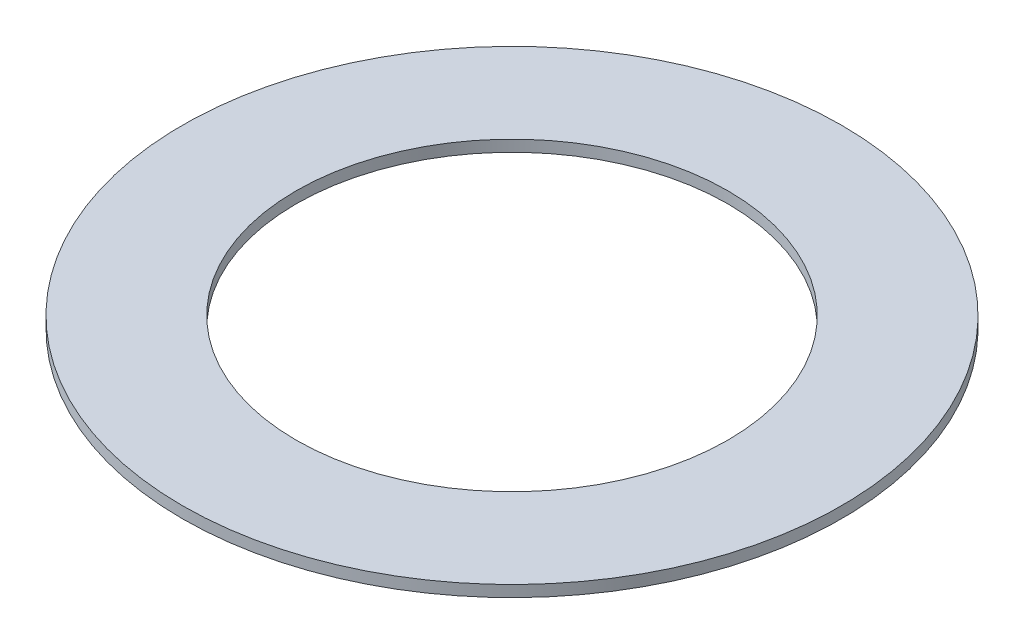
ISO-10303-21;
HEADER;
FILE_DESCRIPTION(('STEP AP214'),'2;1');
FILE_NAME('part.step','',(''),(''),'','','');
FILE_SCHEMA(('AUTOMOTIVE_DESIGN { 1 0 10303 214 1 1 1 1 }'));
ENDSEC;
DATA;
#1=APPLICATION_CONTEXT('core data for automotive mechanical design processes');
#2=APPLICATION_PROTOCOL_DEFINITION('international standard','automotive_design',2000,#1);
#3=PRODUCT_CONTEXT('',#1,'mechanical');
#4=PRODUCT('Part','Part','',(#3));
#5=PRODUCT_RELATED_PRODUCT_CATEGORY('part','',(#4));
#6=PRODUCT_DEFINITION_FORMATION('','',#4);
#7=PRODUCT_DEFINITION_CONTEXT('part definition',#1,'design');
#8=PRODUCT_DEFINITION('design','',#6,#7);
#9=PRODUCT_DEFINITION_SHAPE('','',#8);
#10=(LENGTH_UNIT() NAMED_UNIT(*) SI_UNIT(.MILLI.,.METRE.));
#11=(NAMED_UNIT(*) PLANE_ANGLE_UNIT() SI_UNIT($,.RADIAN.));
#12=(NAMED_UNIT(*) SI_UNIT($,.STERADIAN.) SOLID_ANGLE_UNIT());
#13=UNCERTAINTY_MEASURE_WITH_UNIT(LENGTH_MEASURE(1.E-05),#10,'distance_accuracy_value','');
#14=(GEOMETRIC_REPRESENTATION_CONTEXT(3) GLOBAL_UNCERTAINTY_ASSIGNED_CONTEXT((#13)) GLOBAL_UNIT_ASSIGNED_CONTEXT((#10,
#11,#12)) REPRESENTATION_CONTEXT('',''));
#15=CARTESIAN_POINT('',(0.,0.,0.));
#16=DIRECTION('',(0.,0.,1.));
#17=DIRECTION('',(1.,0.,0.));
#18=AXIS2_PLACEMENT_3D('',#15,#16,#17);
#19=CARTESIAN_POINT('',(0.,0.5,0.));
#20=DIRECTION('',(0.,1.,0.));
#21=DIRECTION('',(0.,0.,1.));
#22=AXIS2_PLACEMENT_3D('',#19,#20,#21);
#23=PLANE('',#22);
#24=CARTESIAN_POINT('',(0.,0.5,0.));
#25=DIRECTION('',(0.,1.,0.));
#26=DIRECTION('',(0.,0.,1.));
#27=AXIS2_PLACEMENT_3D('',#24,#25,#26);
#28=CIRCLE('',#27,14.5);
#29=CARTESIAN_POINT('',(0.,0.5,14.5));
#30=VERTEX_POINT('',#29);
#31=EDGE_CURVE('E11',#30,#30,#28,.T.);
#32=ORIENTED_EDGE('',*,*,#31,.T.);
#33=EDGE_LOOP('',(#32));
#34=FACE_BOUND('',#33,.T.);
#35=CARTESIAN_POINT('',(0.,0.5,0.));
#36=DIRECTION('',(0.,1.,0.));
#37=DIRECTION('',(1.,0.,0.));
#38=AXIS2_PLACEMENT_3D('',#35,#36,#37);
#39=CIRCLE('',#38,9.5);
#40=CARTESIAN_POINT('',(9.5,0.5,0.));
#41=VERTEX_POINT('',#40);
#42=EDGE_CURVE('E49',#41,#41,#39,.T.);
#43=ORIENTED_EDGE('',*,*,#42,.F.);
#44=EDGE_LOOP('',(#43));
#45=FACE_BOUND('',#44,.T.);
#46=ADVANCED_FACE('F38',(#34,#45),#23,.T.);
#47=CARTESIAN_POINT('',(0.,0.,0.));
#48=DIRECTION('',(0.,1.,0.));
#49=DIRECTION('',(0.,0.,1.));
#50=AXIS2_PLACEMENT_3D('',#47,#48,#49);
#51=PLANE('',#50);
#52=CARTESIAN_POINT('',(0.,0.,0.));
#53=DIRECTION('',(0.,1.,0.));
#54=DIRECTION('',(0.,0.,1.));
#55=AXIS2_PLACEMENT_3D('',#52,#53,#54);
#56=CIRCLE('',#55,14.5);
#57=CARTESIAN_POINT('',(0.,0.,14.5));
#58=VERTEX_POINT('',#57);
#59=EDGE_CURVE('E42',#58,#58,#56,.T.);
#60=ORIENTED_EDGE('',*,*,#59,.F.);
#61=EDGE_LOOP('',(#60));
#62=FACE_BOUND('',#61,.T.);
#63=CARTESIAN_POINT('',(0.,0.,0.));
#64=DIRECTION('',(0.,1.,0.));
#65=DIRECTION('',(1.,0.,0.));
#66=AXIS2_PLACEMENT_3D('',#63,#64,#65);
#67=CIRCLE('',#66,9.5);
#68=CARTESIAN_POINT('',(9.5,0.,0.));
#69=VERTEX_POINT('',#68);
#70=EDGE_CURVE('E51',#69,#69,#67,.T.);
#71=ORIENTED_EDGE('',*,*,#70,.T.);
#72=EDGE_LOOP('',(#71));
#73=FACE_BOUND('',#72,.T.);
#74=ADVANCED_FACE('F61',(#62,#73),#51,.F.);
#75=CARTESIAN_POINT('',(0.,0.5,0.));
#76=DIRECTION('',(0.,-1.,0.));
#77=DIRECTION('',(0.,0.,-1.));
#78=AXIS2_PLACEMENT_3D('',#75,#76,#77);
#79=CYLINDRICAL_SURFACE('',#78,14.5);
#80=ORIENTED_EDGE('',*,*,#31,.F.);
#81=EDGE_LOOP('',(#80));
#82=FACE_BOUND('',#81,.T.);
#83=ORIENTED_EDGE('',*,*,#59,.T.);
#84=EDGE_LOOP('',(#83));
#85=FACE_BOUND('',#84,.T.);
#86=ADVANCED_FACE('F40',(#82,#85),#79,.T.);
#87=CARTESIAN_POINT('',(0.,0.5,0.));
#88=DIRECTION('',(0.,-1.,0.));
#89=DIRECTION('',(0.,0.,-1.));
#90=AXIS2_PLACEMENT_3D('',#87,#88,#89);
#91=CYLINDRICAL_SURFACE('',#90,9.5);
#92=ORIENTED_EDGE('',*,*,#42,.T.);
#93=EDGE_LOOP('',(#92));
#94=FACE_BOUND('',#93,.T.);
#95=ORIENTED_EDGE('',*,*,#70,.F.);
#96=EDGE_LOOP('',(#95));
#97=FACE_BOUND('',#96,.T.);
#98=ADVANCED_FACE('F57',(#94,#97),#91,.F.);
#99=CLOSED_SHELL('',(#46,#74,#86,#98));
#100=MANIFOLD_SOLID_BREP('B2',#99);
#101=ADVANCED_BREP_SHAPE_REPRESENTATION('',(#18,#100),#14);
#102=SHAPE_DEFINITION_REPRESENTATION(#9,#101);
ENDSEC;
END-ISO-10303-21;
